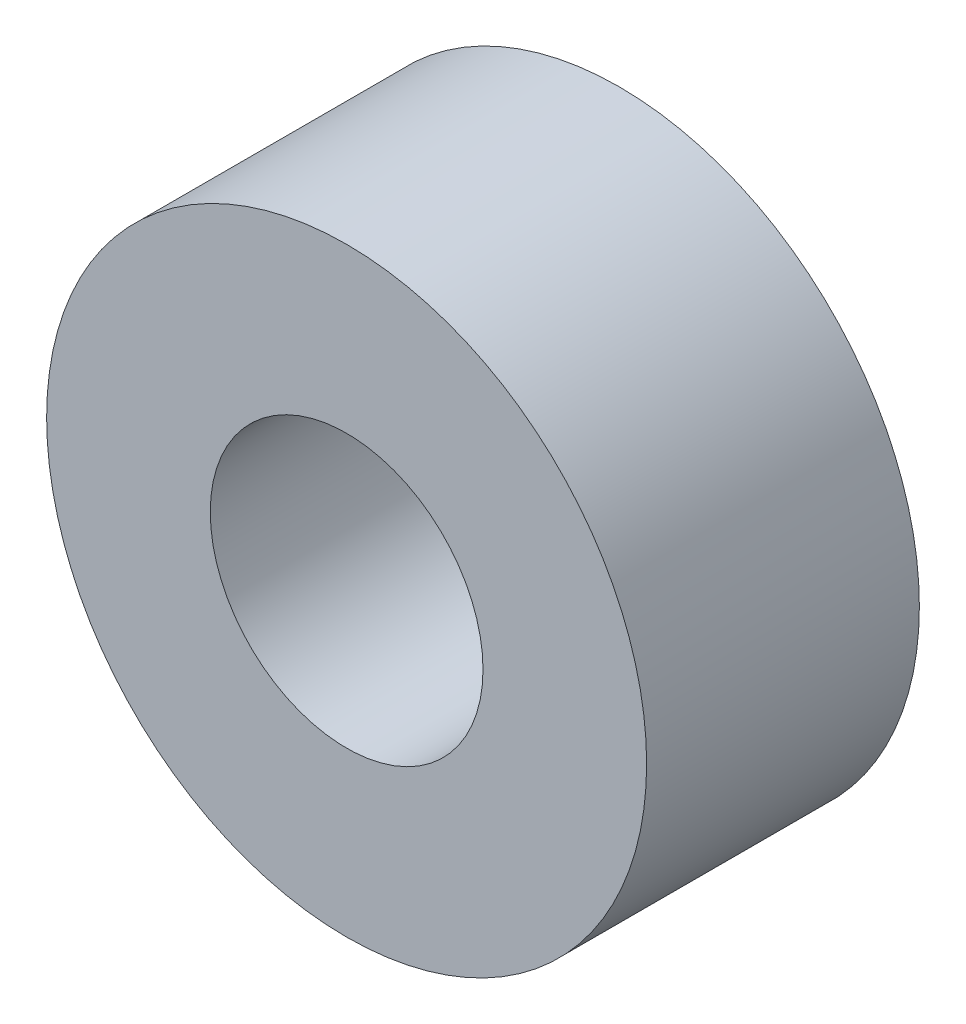
ISO-10303-21;
HEADER;
FILE_DESCRIPTION(('STEP AP214'),'2;1');
FILE_NAME('part.step','',(''),(''),'','','');
FILE_SCHEMA(('AUTOMOTIVE_DESIGN { 1 0 10303 214 1 1 1 1 }'));
ENDSEC;
DATA;
#1=APPLICATION_CONTEXT('core data for automotive mechanical design processes');
#2=APPLICATION_PROTOCOL_DEFINITION('international standard','automotive_design',2000,#1);
#3=PRODUCT_CONTEXT('',#1,'mechanical');
#4=PRODUCT('Part','Part','',(#3));
#5=PRODUCT_RELATED_PRODUCT_CATEGORY('part','',(#4));
#6=PRODUCT_DEFINITION_FORMATION('','',#4);
#7=PRODUCT_DEFINITION_CONTEXT('part definition',#1,'design');
#8=PRODUCT_DEFINITION('design','',#6,#7);
#9=PRODUCT_DEFINITION_SHAPE('','',#8);
#10=(LENGTH_UNIT() NAMED_UNIT(*) SI_UNIT(.MILLI.,.METRE.));
#11=(NAMED_UNIT(*) PLANE_ANGLE_UNIT() SI_UNIT($,.RADIAN.));
#12=(NAMED_UNIT(*) SI_UNIT($,.STERADIAN.) SOLID_ANGLE_UNIT());
#13=UNCERTAINTY_MEASURE_WITH_UNIT(LENGTH_MEASURE(1.E-05),#10,'distance_accuracy_value','');
#14=(GEOMETRIC_REPRESENTATION_CONTEXT(3) GLOBAL_UNCERTAINTY_ASSIGNED_CONTEXT((#13)) GLOBAL_UNIT_ASSIGNED_CONTEXT((#10,
#11,#12)) REPRESENTATION_CONTEXT('',''));
#15=CARTESIAN_POINT('',(0.,0.,0.));
#16=DIRECTION('',(0.,0.,1.));
#17=DIRECTION('',(1.,0.,0.));
#18=AXIS2_PLACEMENT_3D('',#15,#16,#17);
#19=CARTESIAN_POINT('',(0.,0.,5.));
#20=DIRECTION('',(0.,0.,1.));
#21=DIRECTION('',(1.,0.,0.));
#22=AXIS2_PLACEMENT_3D('',#19,#20,#21);
#23=PLANE('',#22);
#24=CARTESIAN_POINT('',(0.,0.,5.));
#25=DIRECTION('',(0.,0.,1.));
#26=DIRECTION('',(1.,0.,0.));
#27=AXIS2_PLACEMENT_3D('',#24,#25,#26);
#28=CIRCLE('',#27,5.5);
#29=CARTESIAN_POINT('',(5.5,0.,5.));
#30=VERTEX_POINT('',#29);
#31=EDGE_CURVE('E10',#30,#30,#28,.T.);
#32=ORIENTED_EDGE('',*,*,#31,.T.);
#33=EDGE_LOOP('',(#32));
#34=FACE_BOUND('',#33,.T.);
#35=CARTESIAN_POINT('',(0.,0.,5.));
#36=DIRECTION('',(0.,0.,1.));
#37=DIRECTION('',(1.,0.,0.));
#38=AXIS2_PLACEMENT_3D('',#35,#36,#37);
#39=CIRCLE('',#38,2.5);
#40=CARTESIAN_POINT('',(2.5,0.,5.));
#41=VERTEX_POINT('',#40);
#42=EDGE_CURVE('E54',#41,#41,#39,.T.);
#43=ORIENTED_EDGE('',*,*,#42,.F.);
#44=EDGE_LOOP('',(#43));
#45=FACE_BOUND('',#44,.T.);
#46=ADVANCED_FACE('F41',(#34,#45),#23,.T.);
#47=CARTESIAN_POINT('',(0.,0.,0.));
#48=DIRECTION('',(0.,0.,1.));
#49=DIRECTION('',(1.,0.,0.));
#50=AXIS2_PLACEMENT_3D('',#47,#48,#49);
#51=PLANE('',#50);
#52=CARTESIAN_POINT('',(0.,0.,0.));
#53=DIRECTION('',(0.,0.,1.));
#54=DIRECTION('',(1.,0.,0.));
#55=AXIS2_PLACEMENT_3D('',#52,#53,#54);
#56=CIRCLE('',#55,5.5);
#57=CARTESIAN_POINT('',(5.5,0.,0.));
#58=VERTEX_POINT('',#57);
#59=EDGE_CURVE('E45',#58,#58,#56,.T.);
#60=ORIENTED_EDGE('',*,*,#59,.F.);
#61=EDGE_LOOP('',(#60));
#62=FACE_BOUND('',#61,.T.);
#63=CARTESIAN_POINT('',(0.,0.,0.));
#64=DIRECTION('',(0.,0.,1.));
#65=DIRECTION('',(1.,0.,0.));
#66=AXIS2_PLACEMENT_3D('',#63,#64,#65);
#67=CIRCLE('',#66,2.5);
#68=CARTESIAN_POINT('',(2.5,0.,0.));
#69=VERTEX_POINT('',#68);
#70=EDGE_CURVE('E56',#69,#69,#67,.T.);
#71=ORIENTED_EDGE('',*,*,#70,.T.);
#72=EDGE_LOOP('',(#71));
#73=FACE_BOUND('',#72,.T.);
#74=ADVANCED_FACE('F68',(#62,#73),#51,.F.);
#75=CARTESIAN_POINT('',(0.,0.,5.));
#76=DIRECTION('',(0.,0.,-1.));
#77=DIRECTION('',(-1.,0.,0.));
#78=AXIS2_PLACEMENT_3D('',#75,#76,#77);
#79=CYLINDRICAL_SURFACE('',#78,5.5);
#80=ORIENTED_EDGE('',*,*,#31,.F.);
#81=EDGE_LOOP('',(#80));
#82=FACE_BOUND('',#81,.T.);
#83=ORIENTED_EDGE('',*,*,#59,.T.);
#84=EDGE_LOOP('',(#83));
#85=FACE_BOUND('',#84,.T.);
#86=ADVANCED_FACE('F43',(#82,#85),#79,.T.);
#87=CARTESIAN_POINT('',(0.,0.,5.));
#88=DIRECTION('',(0.,0.,-1.));
#89=DIRECTION('',(-1.,0.,0.));
#90=AXIS2_PLACEMENT_3D('',#87,#88,#89);
#91=CYLINDRICAL_SURFACE('',#90,2.5);
#92=ORIENTED_EDGE('',*,*,#42,.T.);
#93=EDGE_LOOP('',(#92));
#94=FACE_BOUND('',#93,.T.);
#95=ORIENTED_EDGE('',*,*,#70,.F.);
#96=EDGE_LOOP('',(#95));
#97=FACE_BOUND('',#96,.T.);
#98=ADVANCED_FACE('F64',(#94,#97),#91,.F.);
#99=CLOSED_SHELL('',(#46,#74,#86,#98));
#100=MANIFOLD_SOLID_BREP('B2',#99);
#101=ADVANCED_BREP_SHAPE_REPRESENTATION('',(#18,#100),#14);
#102=SHAPE_DEFINITION_REPRESENTATION(#9,#101);
ENDSEC;
END-ISO-10303-21;
